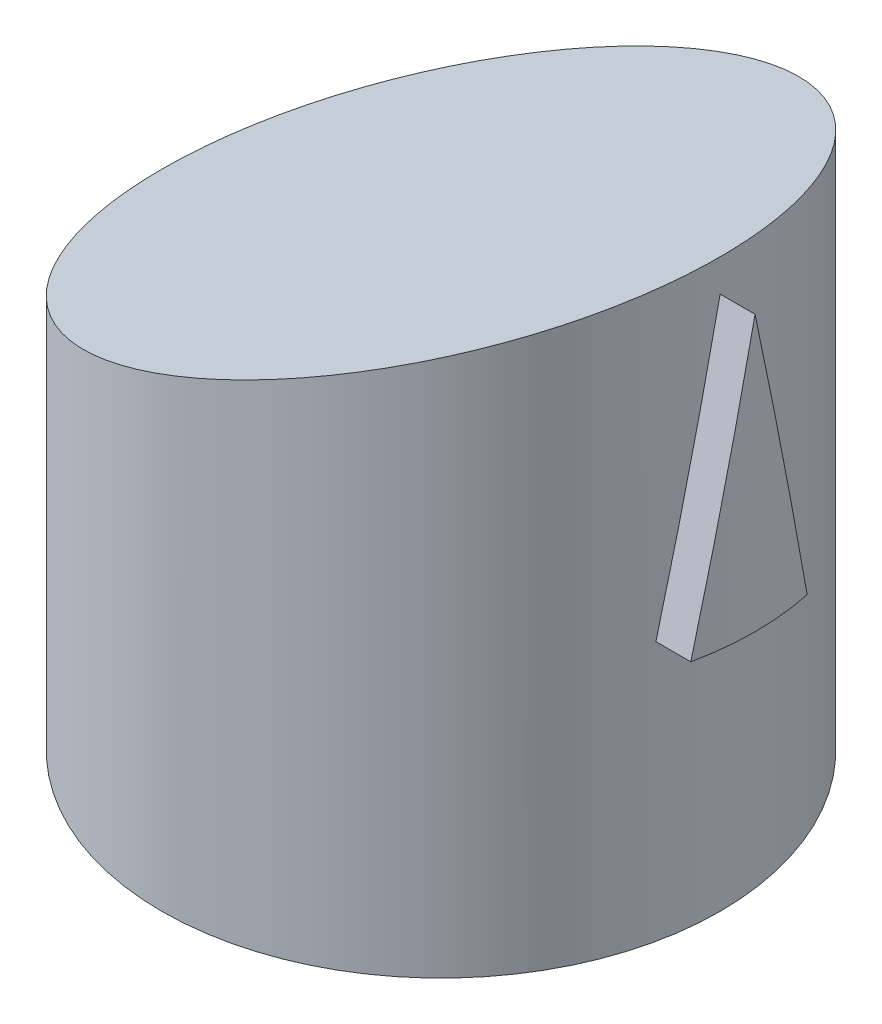
ISO-10303-21;
HEADER;
FILE_DESCRIPTION(('STEP AP214'),'2;1');
FILE_NAME('part.step','',(''),(''),'','','');
FILE_SCHEMA(('AUTOMOTIVE_DESIGN { 1 0 10303 214 1 1 1 1 }'));
ENDSEC;
DATA;
#1=APPLICATION_CONTEXT('core data for automotive mechanical design processes');
#2=APPLICATION_PROTOCOL_DEFINITION('international standard','automotive_design',2000,#1);
#3=PRODUCT_CONTEXT('',#1,'mechanical');
#4=PRODUCT('Part','Part','',(#3));
#5=PRODUCT_RELATED_PRODUCT_CATEGORY('part','',(#4));
#6=PRODUCT_DEFINITION_FORMATION('','',#4);
#7=PRODUCT_DEFINITION_CONTEXT('part definition',#1,'design');
#8=PRODUCT_DEFINITION('design','',#6,#7);
#9=PRODUCT_DEFINITION_SHAPE('','',#8);
#10=(LENGTH_UNIT() NAMED_UNIT(*) SI_UNIT(.MILLI.,.METRE.));
#11=(NAMED_UNIT(*) PLANE_ANGLE_UNIT() SI_UNIT($,.RADIAN.));
#12=(NAMED_UNIT(*) SI_UNIT($,.STERADIAN.) SOLID_ANGLE_UNIT());
#13=UNCERTAINTY_MEASURE_WITH_UNIT(LENGTH_MEASURE(1.E-05),#10,'distance_accuracy_value','');
#14=(GEOMETRIC_REPRESENTATION_CONTEXT(3) GLOBAL_UNCERTAINTY_ASSIGNED_CONTEXT((#13)) GLOBAL_UNIT_ASSIGNED_CONTEXT((#10,
#11,#12)) REPRESENTATION_CONTEXT('',''));
#15=CARTESIAN_POINT('',(0.,0.,0.));
#16=DIRECTION('',(0.,0.,1.));
#17=DIRECTION('',(1.,0.,0.));
#18=AXIS2_PLACEMENT_3D('',#15,#16,#17);
#19=CARTESIAN_POINT('',(0.,0.,0.));
#20=DIRECTION('',(0.,1.,0.));
#21=DIRECTION('',(0.,0.,1.));
#22=AXIS2_PLACEMENT_3D('',#19,#20,#21);
#23=PLANE('',#22);
#24=CARTESIAN_POINT('',(0.,0.,0.));
#25=DIRECTION('',(0.,1.,0.));
#26=DIRECTION('',(0.,0.,1.));
#27=AXIS2_PLACEMENT_3D('',#24,#25,#26);
#28=CIRCLE('',#27,24.);
#29=CARTESIAN_POINT('',(0.,0.,24.));
#30=VERTEX_POINT('',#29);
#31=EDGE_CURVE('E11',#30,#30,#28,.T.);
#32=ORIENTED_EDGE('',*,*,#31,.F.);
#33=EDGE_LOOP('',(#32));
#34=FACE_BOUND('',#33,.T.);
#35=DIRECTION('',(0.,0.,1.));
#36=VECTOR('',#35,1.);
#37=CARTESIAN_POINT('',(-2.5,0.,-1.5));
#38=LINE('',#37,#36);
#39=CARTESIAN_POINT('',(-2.5,0.,-1.5));
#40=VERTEX_POINT('',#39);
#41=CARTESIAN_POINT('',(-2.5,0.,1.5));
#42=VERTEX_POINT('',#41);
#43=EDGE_CURVE('E60',#40,#42,#38,.T.);
#44=ORIENTED_EDGE('',*,*,#43,.T.);
#45=DIRECTION('',(1.,0.,0.));
#46=VECTOR('',#45,1.);
#47=CARTESIAN_POINT('',(-2.5,0.,1.5));
#48=LINE('',#47,#46);
#49=CARTESIAN_POINT('',(2.5,0.,1.5));
#50=VERTEX_POINT('',#49);
#51=EDGE_CURVE('E148',#42,#50,#48,.T.);
#52=ORIENTED_EDGE('',*,*,#51,.T.);
#53=DIRECTION('',(0.,0.,-1.));
#54=VECTOR('',#53,1.);
#55=CARTESIAN_POINT('',(2.5,0.,-1.5));
#56=LINE('',#55,#54);
#57=CARTESIAN_POINT('',(2.5,0.,-1.5));
#58=VERTEX_POINT('',#57);
#59=EDGE_CURVE('E145',#50,#58,#56,.T.);
#60=ORIENTED_EDGE('',*,*,#59,.T.);
#61=DIRECTION('',(-1.,0.,0.));
#62=VECTOR('',#61,1.);
#63=CARTESIAN_POINT('',(-2.5,0.,-1.5));
#64=LINE('',#63,#62);
#65=EDGE_CURVE('E141',#58,#40,#64,.T.);
#66=ORIENTED_EDGE('',*,*,#65,.T.);
#67=EDGE_LOOP('',(#44,#52,#60,#66));
#68=FACE_BOUND('',#67,.T.);
#69=ADVANCED_FACE('F33',(#34,#68),#23,.F.);
#70=CARTESIAN_POINT('',(0.,6.,0.));
#71=DIRECTION('',(0.,-1.,0.));
#72=DIRECTION('',(0.,0.,-1.));
#73=AXIS2_PLACEMENT_3D('',#70,#71,#72);
#74=CYLINDRICAL_SURFACE('',#73,24.);
#75=CARTESIAN_POINT('',(23.473389188611,22.320096473956,-5.));
#76=CARTESIAN_POINT('',(23.7359565417383,28.1474779458997,-3.76733086636394));
#77=CARTESIAN_POINT('',(23.8679842103042,34.0733512325724,-2.5138277062416));
#78=CARTESIAN_POINT('',(24.,39.998691353128,-1.26043732703446));
#79=CARTESIAN_POINT('',(24.,45.9573455659101,0.));
#80=B_SPLINE_CURVE_WITH_KNOTS('',2,(#75,#76,#77,#78,#79),.UNSPECIFIED.,.F.,.F.,(3,2,3),(0.,0.5,
1.),.UNSPECIFIED.);
#81=CARTESIAN_POINT('',(23.473389188611,22.320096473956,-5.));
#82=VERTEX_POINT('',#81);
#83=CARTESIAN_POINT('',(24.,45.9573455659101,0.));
#84=VERTEX_POINT('',#83);
#85=EDGE_CURVE('E113',#82,#84,#80,.T.);
#86=ORIENTED_EDGE('',*,*,#85,.F.);
#87=CARTESIAN_POINT('',(0.,22.320096473956,0.));
#88=DIRECTION('',(0.,1.,0.));
#89=DIRECTION('',(0.,0.,1.));
#90=AXIS2_PLACEMENT_3D('',#87,#88,#89);
#91=CIRCLE('',#90,24.);
#92=CARTESIAN_POINT('',(23.473389188611,22.320096473956,5.));
#93=VERTEX_POINT('',#92);
#94=EDGE_CURVE('E52',#93,#82,#91,.T.);
#95=ORIENTED_EDGE('',*,*,#94,.F.);
#96=CARTESIAN_POINT('',(24.,45.9573455659101,0.));
#97=CARTESIAN_POINT('',(24.,39.9992304338133,1.26032329500746));
#98=CARTESIAN_POINT('',(23.8679842103042,34.0733512325724,2.5138277062416));
#99=CARTESIAN_POINT('',(23.7359802984106,28.1480051980134,3.76721933644107));
#100=CARTESIAN_POINT('',(23.473389188611,22.320096473956,5.));
#101=B_SPLINE_CURVE_WITH_KNOTS('',2,(#96,#97,#98,#99,#100),.UNSPECIFIED.,.F.,.F.,(3,2,3),(0.,
0.5,1.),.UNSPECIFIED.);
#102=EDGE_CURVE('E105',#84,#93,#101,.T.);
#103=ORIENTED_EDGE('',*,*,#102,.F.);
#104=EDGE_LOOP('',(#86,#95,#103));
#105=FACE_BOUND('',#104,.T.);
#106=ORIENTED_EDGE('',*,*,#31,.T.);
#107=EDGE_LOOP('',(#106));
#108=FACE_BOUND('',#107,.T.);
#109=CARTESIAN_POINT('',(0.,40.,0.));
#110=DIRECTION('',(0.342020143325669,-0.939692620785908,0.));
#111=DIRECTION('',(-0.939692620785908,-0.342020143325669,0.));
#112=AXIS2_PLACEMENT_3D('',#109,#110,#111);
#113=ELLIPSE('',#112,25.5402665394219,24.);
#114=CARTESIAN_POINT('',(-24.,31.2647143776111,0.));
#115=VERTEX_POINT('',#114);
#116=EDGE_CURVE('E119',#115,#115,#113,.T.);
#117=ORIENTED_EDGE('',*,*,#116,.T.);
#118=EDGE_LOOP('',(#117));
#119=FACE_BOUND('',#118,.T.);
#120=ADVANCED_FACE('F35',(#105,#108,#119),#74,.T.);
#121=CARTESIAN_POINT('',(-2.5,6.,-1.5));
#122=DIRECTION('',(1.,0.,0.));
#123=DIRECTION('',(0.,0.,-1.));
#124=AXIS2_PLACEMENT_3D('',#121,#122,#123);
#125=PLANE('',#124);
#126=ORIENTED_EDGE('',*,*,#43,.F.);
#127=DIRECTION('',(0.,-1.,0.));
#128=VECTOR('',#127,1.);
#129=CARTESIAN_POINT('',(-2.5,6.,-1.5));
#130=LINE('',#129,#128);
#131=CARTESIAN_POINT('',(-2.5,6.,-1.5));
#132=VERTEX_POINT('',#131);
#133=EDGE_CURVE('E138',#132,#40,#130,.T.);
#134=ORIENTED_EDGE('',*,*,#133,.F.);
#135=DIRECTION('',(0.,0.,1.));
#136=VECTOR('',#135,1.);
#137=CARTESIAN_POINT('',(-2.5,6.,-1.5));
#138=LINE('',#137,#136);
#139=CARTESIAN_POINT('',(-2.5,6.,1.5));
#140=VERTEX_POINT('',#139);
#141=EDGE_CURVE('E144',#132,#140,#138,.T.);
#142=ORIENTED_EDGE('',*,*,#141,.T.);
#143=DIRECTION('',(0.,-1.,0.));
#144=VECTOR('',#143,1.);
#145=CARTESIAN_POINT('',(-2.5,6.,1.5));
#146=LINE('',#145,#144);
#147=EDGE_CURVE('E44',#140,#42,#146,.T.);
#148=ORIENTED_EDGE('',*,*,#147,.T.);
#149=EDGE_LOOP('',(#126,#134,#142,#148));
#150=FACE_BOUND('',#149,.T.);
#151=ADVANCED_FACE('F242',(#150),#125,.T.);
#152=CARTESIAN_POINT('',(-2.5,6.,1.5));
#153=DIRECTION('',(0.,0.,-1.));
#154=DIRECTION('',(-1.,0.,0.));
#155=AXIS2_PLACEMENT_3D('',#152,#153,#154);
#156=PLANE('',#155);
#157=ORIENTED_EDGE('',*,*,#51,.F.);
#158=ORIENTED_EDGE('',*,*,#147,.F.);
#159=DIRECTION('',(1.,0.,0.));
#160=VECTOR('',#159,1.);
#161=CARTESIAN_POINT('',(-2.5,6.,1.5));
#162=LINE('',#161,#160);
#163=CARTESIAN_POINT('',(2.5,6.,1.5));
#164=VERTEX_POINT('',#163);
#165=EDGE_CURVE('E157',#140,#164,#162,.T.);
#166=ORIENTED_EDGE('',*,*,#165,.T.);
#167=DIRECTION('',(0.,-1.,0.));
#168=VECTOR('',#167,1.);
#169=CARTESIAN_POINT('',(2.5,6.,1.5));
#170=LINE('',#169,#168);
#171=EDGE_CURVE('E134',#164,#50,#170,.T.);
#172=ORIENTED_EDGE('',*,*,#171,.T.);
#173=EDGE_LOOP('',(#157,#158,#166,#172));
#174=FACE_BOUND('',#173,.T.);
#175=ADVANCED_FACE('F238',(#174),#156,.T.);
#176=CARTESIAN_POINT('',(2.5,6.,-1.5));
#177=DIRECTION('',(-1.,0.,0.));
#178=DIRECTION('',(0.,0.,1.));
#179=AXIS2_PLACEMENT_3D('',#176,#177,#178);
#180=PLANE('',#179);
#181=ORIENTED_EDGE('',*,*,#59,.F.);
#182=ORIENTED_EDGE('',*,*,#171,.F.);
#183=DIRECTION('',(0.,0.,-1.));
#184=VECTOR('',#183,1.);
#185=CARTESIAN_POINT('',(2.5,6.,-1.5));
#186=LINE('',#185,#184);
#187=CARTESIAN_POINT('',(2.5,6.,-1.5));
#188=VERTEX_POINT('',#187);
#189=EDGE_CURVE('E154',#164,#188,#186,.T.);
#190=ORIENTED_EDGE('',*,*,#189,.T.);
#191=DIRECTION('',(0.,-1.,0.));
#192=VECTOR('',#191,1.);
#193=CARTESIAN_POINT('',(2.5,6.,-1.5));
#194=LINE('',#193,#192);
#195=EDGE_CURVE('E136',#188,#58,#194,.T.);
#196=ORIENTED_EDGE('',*,*,#195,.T.);
#197=EDGE_LOOP('',(#181,#182,#190,#196));
#198=FACE_BOUND('',#197,.T.);
#199=ADVANCED_FACE('F234',(#198),#180,.T.);
#200=CARTESIAN_POINT('',(-2.5,6.,-1.5));
#201=DIRECTION('',(0.,0.,1.));
#202=DIRECTION('',(1.,0.,0.));
#203=AXIS2_PLACEMENT_3D('',#200,#201,#202);
#204=PLANE('',#203);
#205=ORIENTED_EDGE('',*,*,#65,.F.);
#206=ORIENTED_EDGE('',*,*,#195,.F.);
#207=DIRECTION('',(-1.,0.,0.));
#208=VECTOR('',#207,1.);
#209=CARTESIAN_POINT('',(-2.5,6.,-1.5));
#210=LINE('',#209,#208);
#211=EDGE_CURVE('E140',#188,#132,#210,.T.);
#212=ORIENTED_EDGE('',*,*,#211,.T.);
#213=ORIENTED_EDGE('',*,*,#133,.T.);
#214=EDGE_LOOP('',(#205,#206,#212,#213));
#215=FACE_BOUND('',#214,.T.);
#216=ADVANCED_FACE('F230',(#215),#204,.T.);
#217=CARTESIAN_POINT('',(0.,6.,0.));
#218=DIRECTION('',(0.,1.,0.));
#219=DIRECTION('',(0.,0.,1.));
#220=AXIS2_PLACEMENT_3D('',#217,#218,#219);
#221=PLANE('',#220);
#222=ORIENTED_EDGE('',*,*,#141,.F.);
#223=ORIENTED_EDGE('',*,*,#211,.F.);
#224=ORIENTED_EDGE('',*,*,#189,.F.);
#225=ORIENTED_EDGE('',*,*,#165,.F.);
#226=EDGE_LOOP('',(#222,#223,#224,#225));
#227=FACE_BOUND('',#226,.T.);
#228=ADVANCED_FACE('F226',(#227),#221,.F.);
#229=CARTESIAN_POINT('',(-12.8557521937308,35.3208888623795,0.));
#230=DIRECTION('',(0.342020143325669,-0.939692620785908,0.));
#231=DIRECTION('',(0.939692620785908,0.342020143325669,0.));
#232=AXIS2_PLACEMENT_3D('',#229,#230,#231);
#233=PLANE('',#232);
#234=ORIENTED_EDGE('',*,*,#116,.F.);
#235=EDGE_LOOP('',(#234));
#236=FACE_BOUND('',#235,.T.);
#237=ADVANCED_FACE('F208',(#236),#233,.F.);
#238=CARTESIAN_POINT('',(3.,6.,0.));
#239=DIRECTION('',(0.,-1.,0.));
#240=DIRECTION('',(0.,0.,-1.));
#241=AXIS2_PLACEMENT_3D('',#238,#239,#240);
#242=CYLINDRICAL_SURFACE('',#241,24.);
#243=CARTESIAN_POINT('',(3.,22.320096473956,0.));
#244=DIRECTION('',(0.,1.,0.));
#245=DIRECTION('',(0.,0.,1.));
#246=AXIS2_PLACEMENT_3D('',#243,#244,#245);
#247=CIRCLE('',#246,24.);
#248=CARTESIAN_POINT('',(26.473389188611,22.320096473956,5.));
#249=VERTEX_POINT('',#248);
#250=CARTESIAN_POINT('',(26.473389188611,22.320096473956,-5.));
#251=VERTEX_POINT('',#250);
#252=EDGE_CURVE('E197',#249,#251,#247,.T.);
#253=ORIENTED_EDGE('',*,*,#252,.T.);
#254=CARTESIAN_POINT('',(26.473389188611,22.320096473956,-5.));
#255=CARTESIAN_POINT('',(26.4873941442082,22.6309214578798,-4.93425110756474));
#256=CARTESIAN_POINT('',(26.5011108459494,22.9417589616914,-4.86850002680954));
#257=CARTESIAN_POINT('',(26.5282124934899,23.5690565007028,-4.7358087827351));
#258=CARTESIAN_POINT('',(26.5415870142568,23.8855169679495,-4.66886853243271));
#259=CARTESIAN_POINT('',(26.5679759816742,24.5240604251486,-4.5337982432825));
#260=CARTESIAN_POINT('',(26.5809798710603,24.8461438310202,-4.4656681081839));
#261=CARTESIAN_POINT('',(26.6065986994326,25.4959331862991,-4.32821784207437));
#262=CARTESIAN_POINT('',(26.6192029461195,25.8236395368867,-4.25889761468942));
#263=CARTESIAN_POINT('',(26.6439931374361,26.4846747993699,-4.11906737775698));
#264=CARTESIAN_POINT('',(26.656168253534,26.8180040984419,-4.04855727890796));
#265=CARTESIAN_POINT('',(26.6800703658352,27.4902852521302,-3.90634779987584));
#266=CARTESIAN_POINT('',(26.6917863963112,27.8292374802584,-3.83464834192438));
#267=CARTESIAN_POINT('',(26.7135447190694,28.4771721109145,-3.6975905746744));
#268=CARTESIAN_POINT('',(26.7236433821715,28.7861526753299,-3.63223251683332));
#269=CARTESIAN_POINT('',(26.743531148904,29.4117468212605,-3.4999021348801));
#270=CARTESIAN_POINT('',(26.7533064868153,29.7283608234276,-3.43292972994673));
#271=CARTESIAN_POINT('',(26.7725083143635,30.3692218353495,-3.29736967880335));
#272=CARTESIAN_POINT('',(26.7819207553981,30.69346924481,-3.22878193230743));
#273=CARTESIAN_POINT('',(26.800356536805,31.3495971018458,-3.08999091767872));
#274=CARTESIAN_POINT('',(26.8093655429938,31.6814779306296,-3.01978754747781));
#275=CARTESIAN_POINT('',(26.8269532776958,32.3528726313149,-2.87776549164642));
#276=CARTESIAN_POINT('',(26.8355173848881,32.6923868666444,-2.80594671344974));
#277=CARTESIAN_POINT('',(26.8521731888885,33.3790484396788,-2.6606948854316));
#278=CARTESIAN_POINT('',(26.8602499751247,33.7261961254709,-2.58726177069383));
#279=CARTESIAN_POINT('',(26.8750882650527,34.3922203682822,-2.44637700139946));
#280=CARTESIAN_POINT('',(26.8819033162604,34.7110957652037,-2.37892549530204));
#281=CARTESIAN_POINT('',(26.8951762107821,35.3595698940245,-2.24175378888197));
#282=CARTESIAN_POINT('',(26.9016143638377,35.6891690091839,-2.17203349424873));
#283=CARTESIAN_POINT('',(26.9140754690258,36.3590906224779,-2.0303242941046));
#284=CARTESIAN_POINT('',(26.9200781259526,36.6994134802426,-1.95833530318106));
#285=CARTESIAN_POINT('',(26.9310121892697,37.3550348762003,-1.81965144355927));
#286=CARTESIAN_POINT('',(26.9359899162229,37.6703326657631,-1.75295668236164));
#287=CARTESIAN_POINT('',(26.9456067722151,38.3157983412175,-1.61642137560918));
#288=CARTESIAN_POINT('',(26.9502188813101,38.6459666096537,-1.54658073398622));
#289=CARTESIAN_POINT('',(26.9590238379995,39.3211732483248,-1.40375348116544));
#290=CARTESIAN_POINT('',(26.9631884671872,39.666211966734,-1.33076677424823));
#291=CARTESIAN_POINT('',(26.9704133574023,40.3170426767362,-1.1930963856084));
#292=CARTESIAN_POINT('',(26.9735453563978,40.6228338834942,-1.12841274598694));
#293=CARTESIAN_POINT('',(26.9795157333278,41.2590203165046,-0.993840598325686));
#294=CARTESIAN_POINT('',(26.9823102229731,41.5894159309622,-0.923951975163412));
#295=CARTESIAN_POINT('',(26.9874728409126,42.2748110866052,-0.778969014574857));
#296=CARTESIAN_POINT('',(26.9897937331474,42.6298109512748,-0.703874516192994));
#297=CARTESIAN_POINT('',(26.993185688716,43.2416577427137,-0.5744513880488));
#298=CARTESIAN_POINT('',(26.9944248923744,43.4985036132283,-0.520122097772512));
#299=CARTESIAN_POINT('',(26.9968356914898,44.085630624233,-0.395928622502139));
#300=CARTESIAN_POINT('',(26.9978866617189,44.4159121585455,-0.326063922908104));
#301=CARTESIAN_POINT('',(26.9995441852984,45.1499107699542,-0.170799564026847));
#302=CARTESIAN_POINT('',(26.9999999736517,45.5536281293341,-0.0853996039042422));
#303=CARTESIAN_POINT('',(27.,45.9573455659101,0.));
#304=B_SPLINE_CURVE_WITH_KNOTS('',3,(#254,#255,#256,#257,#258,#259,#260,#261,#262,#263,#264,
#265,#266,#267,#268,#269,#270,#271,#272,#273,#274,#275,#276,#277,#278,#279,#280,#281,#282,#283,
#284,#285,#286,#287,#288,#289,#290,#291,#292,#293,#294,#295,#296,#297,#298,#299,#300,#301,#302,
#303),.UNSPECIFIED.,.F.,.F.,(4,2,2,2,2,2,2,2,2,2,2,2,2,2,2,2,2,2,2,2,2,2,2,2,4),(0.,
0.954033948398823,1.92525115380176,2.9136517356961,3.91923580743104,4.94200347662997,
5.98195484556868,6.92989098998521,7.90119247260787,8.89585935469586,9.91389169325533,
10.9552895414202,12.0200529487915,12.9980601291518,14.0089213353548,15.052636593594,
16.019575092786,17.0320915240608,18.0901858994383,19.0279052614006,20.0410589057916,
21.1296468328869,21.917242358647,22.9300165297746,24.1679693058675),.UNSPECIFIED.);
#305=CARTESIAN_POINT('',(27.,45.9573455659101,0.));
#306=VERTEX_POINT('',#305);
#307=EDGE_CURVE('E120',#251,#306,#304,.T.);
#308=ORIENTED_EDGE('',*,*,#307,.T.);
#309=CARTESIAN_POINT('',(27.,45.9573455659101,0.));
#310=CARTESIAN_POINT('',(26.999999973683,45.5536474003313,0.0853955262290187));
#311=CARTESIAN_POINT('',(26.9995442288239,45.1499493123916,0.170791410766696));
#312=CARTESIAN_POINT('',(26.9978868278536,44.4159699724118,0.326051695095974));
#313=CARTESIAN_POINT('',(26.9968358932164,44.0856884381815,0.395916395609842));
#314=CARTESIAN_POINT('',(26.9944250782909,43.4985421557339,0.520113946928318));
#315=CARTESIAN_POINT('',(26.993185795523,43.2416770138918,0.574447312649277));
#316=CARTESIAN_POINT('',(26.989793887689,42.6298388206364,0.703868619633068));
#317=CARTESIAN_POINT('',(26.987473205427,42.2748668249335,0.778957220943232));
#318=CARTESIAN_POINT('',(26.9823109043354,41.5894995383784,0.923934289115673));
#319=CARTESIAN_POINT('',(26.9795164661463,41.2591039243426,0.993822916329759));
#320=CARTESIAN_POINT('',(26.9735459270656,40.6228896218201,1.12840096055772));
#321=CARTESIAN_POINT('',(26.9704136666395,40.3170705456587,1.19309049303896));
#322=CARTESIAN_POINT('',(26.96318878412,39.6662405027194,1.33076073514595));
#323=CARTESIAN_POINT('',(26.9590245272288,39.3212303196365,1.40374140265957));
#324=CARTESIAN_POINT('',(26.9502200507627,38.6460522164083,1.54656262354216));
#325=CARTESIAN_POINT('',(26.945607994251,38.3158839486847,1.61640327200728));
#326=CARTESIAN_POINT('',(26.9359908166826,37.6703897370735,1.75294461778066));
#327=CARTESIAN_POINT('',(26.9310126648495,37.3550634114634,1.81964541144456));
#328=CARTESIAN_POINT('',(26.9200786042844,36.699442141332,1.9583292362144));
#329=CARTESIAN_POINT('',(26.9140764808392,36.3591479437243,2.03031216002686));
#330=CARTESIAN_POINT('',(26.9016160169137,35.6892549906356,2.17201530302101));
#331=CARTESIAN_POINT('',(26.8951779165107,35.3596558764136,2.24173560695055));
#332=CARTESIAN_POINT('',(26.8819045402723,34.7111530865101,2.3789133810872));
#333=CARTESIAN_POINT('',(26.8750889028404,34.3922490286708,2.4463709457791));
#334=CARTESIAN_POINT('',(26.8602503704828,33.7262138354359,2.58725801693269));
#335=CARTESIAN_POINT('',(26.8521740150171,33.3790838581449,2.66068737465272));
#336=CARTESIAN_POINT('',(26.8355189685606,32.6924506192453,2.80593320208864));
#337=CARTESIAN_POINT('',(26.8269551736927,32.3529470098221,2.87774973634305));
#338=CARTESIAN_POINT('',(26.8093679176717,31.6815664766829,3.01976880673064));
#339=CARTESIAN_POINT('',(26.8003590639433,31.3496891898689,3.08997143525729));
#340=CARTESIAN_POINT('',(26.7819234005649,30.6935613327543,3.22876246519052));
#341=CARTESIAN_POINT('',(26.7725109117673,30.3693103816007,3.2973509685627));
#342=CARTESIAN_POINT('',(26.7533087626542,29.7284352024508,3.43291402747012));
#343=CARTESIAN_POINT('',(26.7435331381718,29.4118105751343,3.49988868329456));
#344=CARTESIAN_POINT('',(26.723644535904,28.7861880939579,3.63222505013108));
#345=CARTESIAN_POINT('',(26.7135453116008,28.4771898198968,3.6975868422488));
#346=CARTESIAN_POINT('',(26.6917866658323,27.8292454358567,3.83464664420008));
#347=CARTESIAN_POINT('',(26.6800709210218,27.4903011623692,3.90634440243998));
#348=CARTESIAN_POINT('',(26.6561692959726,26.8180327365944,4.04855116945195));
#349=CARTESIAN_POINT('',(26.6439943750541,26.4847082109669,4.11906025572297));
#350=CARTESIAN_POINT('',(26.6192044720312,25.8236793128322,4.25888914651769));
#351=CARTESIAN_POINT('',(26.6066003122142,25.4959745533533,4.32820904019888));
#352=CARTESIAN_POINT('',(26.5809815370791,24.8461851980375,4.46565931605895));
#353=CARTESIAN_POINT('',(26.5679776079942,24.5241002012347,4.53378979449067));
#354=CARTESIAN_POINT('',(26.5415884231162,23.8855503798342,4.66886144367072));
#355=CARTESIAN_POINT('',(26.5282137186933,23.5690851395489,4.73580271061045));
#356=CARTESIAN_POINT('',(26.5011115488311,22.94177487209,4.86849665760724));
#357=CARTESIAN_POINT('',(26.4873945026983,22.6309294131195,4.93424942465707));
#358=CARTESIAN_POINT('',(26.473389188611,22.320096473956,5.));
#359=B_SPLINE_CURVE_WITH_KNOTS('',3,(#309,#310,#311,#312,#313,#314,#315,#316,#317,#318,#319,
#320,#321,#322,#323,#324,#325,#326,#327,#328,#329,#330,#331,#332,#333,#334,#335,#336,#337,#338,
#339,#340,#341,#342,#343,#344,#345,#346,#347,#348,#349,#350,#351,#352,#353,#354,#355,#356,#357,
#358),.UNSPECIFIED.,.F.,.F.,(4,2,2,2,2,2,2,2,2,2,2,2,2,2,2,2,2,2,2,2,2,2,2,2,4),(0.,
1.23789368308037,2.25066785420795,3.03832247300205,4.12682493987452,5.13997858426549,
6.07778340646074,7.13579027263289,8.1483067039077,9.11533271231104,10.1589600703104,
11.1698212765134,12.1479163571177,13.2126254413039,14.2539906955545,15.2720121694752,
16.266689916202,17.2380239927394,18.1860144603407,19.2259414117402,20.2486944304077,
21.2542736186299,22.2426790840387,23.2139109399889,24.16796930597),.UNSPECIFIED.);
#360=EDGE_CURVE('E107',#306,#249,#359,.T.);
#361=ORIENTED_EDGE('',*,*,#360,.T.);
#362=EDGE_LOOP('',(#253,#308,#361));
#363=FACE_BOUND('',#362,.T.);
#364=ADVANCED_FACE('F199',(#363),#242,.T.);
#365=CARTESIAN_POINT('',(23.473389188611,22.320096473956,-5.));
#366=DIRECTION('',(0.,-1.,0.));
#367=DIRECTION('',(0.,0.,-1.));
#368=AXIS2_PLACEMENT_3D('',#365,#366,#367);
#369=PLANE('',#368);
#370=ORIENTED_EDGE('',*,*,#252,.F.);
#371=DIRECTION('',(1.,0.,0.));
#372=VECTOR('',#371,1.);
#373=CARTESIAN_POINT('',(23.473389188611,22.320096473956,5.));
#374=LINE('',#373,#372);
#375=EDGE_CURVE('E335',#93,#249,#374,.T.);
#376=ORIENTED_EDGE('',*,*,#375,.F.);
#377=ORIENTED_EDGE('',*,*,#94,.T.);
#378=DIRECTION('',(1.,0.,0.));
#379=VECTOR('',#378,1.);
#380=CARTESIAN_POINT('',(23.473389188611,22.320096473956,-5.));
#381=LINE('',#380,#379);
#382=EDGE_CURVE('E116',#82,#251,#381,.T.);
#383=ORIENTED_EDGE('',*,*,#382,.T.);
#384=EDGE_LOOP('',(#370,#376,#377,#383));
#385=FACE_BOUND('',#384,.T.);
#386=ADVANCED_FACE('F177',(#385),#369,.T.);
#387=CARTESIAN_POINT('',(23.473389188611,22.320096473956,5.));
#388=DIRECTION('',(0.,0.206951170383396,0.97835127284475));
#389=DIRECTION('',(0.,-0.97835127284475,0.206951170383396));
#390=AXIS2_PLACEMENT_3D('',#387,#388,#389);
#391=PLANE('',#390);
#392=ORIENTED_EDGE('',*,*,#360,.F.);
#393=DIRECTION('',(1.,0.,0.));
#394=VECTOR('',#393,1.);
#395=CARTESIAN_POINT('',(24.,45.9573455659101,0.));
#396=LINE('',#395,#394);
#397=EDGE_CURVE('E100',#84,#306,#396,.T.);
#398=ORIENTED_EDGE('',*,*,#397,.F.);
#399=ORIENTED_EDGE('',*,*,#102,.T.);
#400=ORIENTED_EDGE('',*,*,#375,.T.);
#401=EDGE_LOOP('',(#392,#398,#399,#400));
#402=FACE_BOUND('',#401,.T.);
#403=ADVANCED_FACE('F102',(#402),#391,.T.);
#404=CARTESIAN_POINT('',(24.,45.9573455659101,0.));
#405=DIRECTION('',(0.,0.206951170383396,-0.97835127284475));
#406=DIRECTION('',(0.,0.97835127284475,0.206951170383396));
#407=AXIS2_PLACEMENT_3D('',#404,#405,#406);
#408=PLANE('',#407);
#409=ORIENTED_EDGE('',*,*,#307,.F.);
#410=ORIENTED_EDGE('',*,*,#382,.F.);
#411=ORIENTED_EDGE('',*,*,#85,.T.);
#412=ORIENTED_EDGE('',*,*,#397,.T.);
#413=EDGE_LOOP('',(#409,#410,#411,#412));
#414=FACE_BOUND('',#413,.T.);
#415=ADVANCED_FACE('F115',(#414),#408,.T.);
#416=CLOSED_SHELL('',(#69,#120,#151,#175,#199,#216,#228,#237,#364,#386,#403,#415));
#417=MANIFOLD_SOLID_BREP('B2',#416);
#418=ADVANCED_BREP_SHAPE_REPRESENTATION('',(#18,#417),#14);
#419=SHAPE_DEFINITION_REPRESENTATION(#9,#418);
ENDSEC;
END-ISO-10303-21;
